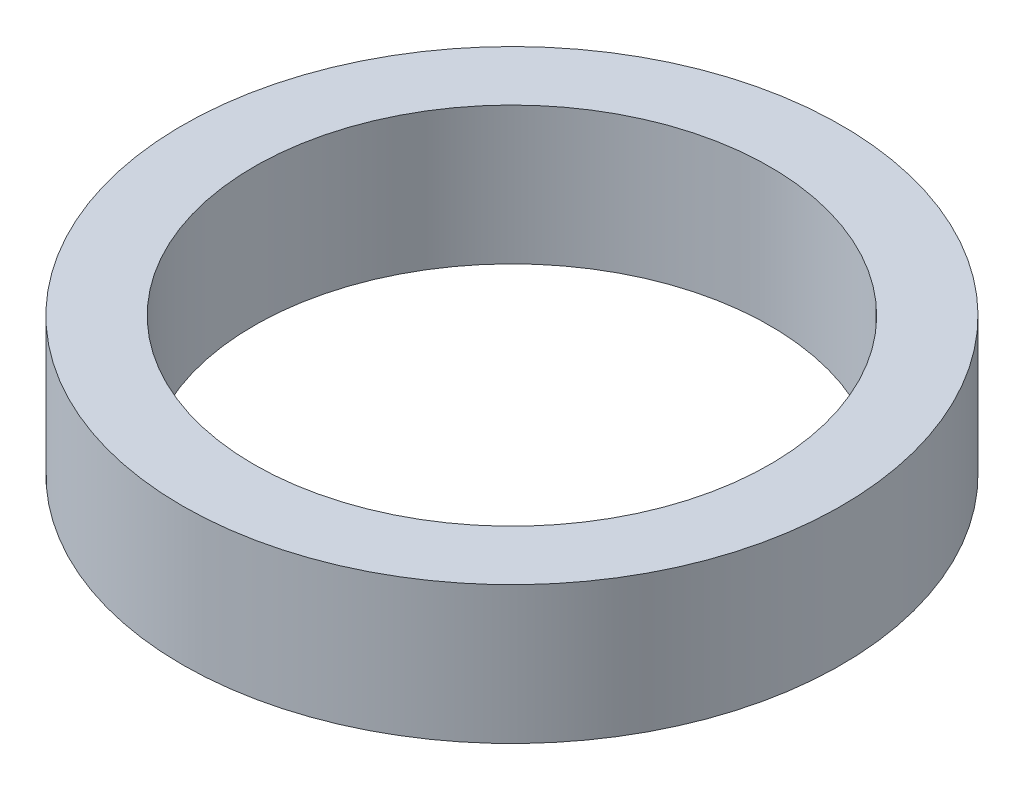
ISO-10303-21;
HEADER;
FILE_DESCRIPTION(('STEP AP214'),'2;1');
FILE_NAME('part.step','',(''),(''),'','','');
FILE_SCHEMA(('AUTOMOTIVE_DESIGN { 1 0 10303 214 1 1 1 1 }'));
ENDSEC;
DATA;
#1=APPLICATION_CONTEXT('core data for automotive mechanical design processes');
#2=APPLICATION_PROTOCOL_DEFINITION('international standard','automotive_design',2000,#1);
#3=PRODUCT_CONTEXT('',#1,'mechanical');
#4=PRODUCT('Part','Part','',(#3));
#5=PRODUCT_RELATED_PRODUCT_CATEGORY('part','',(#4));
#6=PRODUCT_DEFINITION_FORMATION('','',#4);
#7=PRODUCT_DEFINITION_CONTEXT('part definition',#1,'design');
#8=PRODUCT_DEFINITION('design','',#6,#7);
#9=PRODUCT_DEFINITION_SHAPE('','',#8);
#10=(LENGTH_UNIT() NAMED_UNIT(*) SI_UNIT(.MILLI.,.METRE.));
#11=(NAMED_UNIT(*) PLANE_ANGLE_UNIT() SI_UNIT($,.RADIAN.));
#12=(NAMED_UNIT(*) SI_UNIT($,.STERADIAN.) SOLID_ANGLE_UNIT());
#13=UNCERTAINTY_MEASURE_WITH_UNIT(LENGTH_MEASURE(1.E-05),#10,'distance_accuracy_value','');
#14=(GEOMETRIC_REPRESENTATION_CONTEXT(3) GLOBAL_UNCERTAINTY_ASSIGNED_CONTEXT((#13)) GLOBAL_UNIT_ASSIGNED_CONTEXT((#10,
#11,#12)) REPRESENTATION_CONTEXT('',''));
#15=CARTESIAN_POINT('',(0.,0.,0.));
#16=DIRECTION('',(0.,0.,1.));
#17=DIRECTION('',(1.,0.,0.));
#18=AXIS2_PLACEMENT_3D('',#15,#16,#17);
#19=CARTESIAN_POINT('',(0.,24.,0.));
#20=DIRECTION('',(0.,-1.,0.));
#21=DIRECTION('',(0.,0.,-1.));
#22=AXIS2_PLACEMENT_3D('',#19,#20,#21);
#23=CYLINDRICAL_SURFACE('',#22,57.5);
#24=CARTESIAN_POINT('',(0.,24.,0.));
#25=DIRECTION('',(0.,1.,0.));
#26=DIRECTION('',(0.,0.,1.));
#27=AXIS2_PLACEMENT_3D('',#24,#25,#26);
#28=CIRCLE('',#27,57.5);
#29=CARTESIAN_POINT('',(0.,24.,57.5));
#30=VERTEX_POINT('',#29);
#31=EDGE_CURVE('E10',#30,#30,#28,.T.);
#32=ORIENTED_EDGE('',*,*,#31,.F.);
#33=EDGE_LOOP('',(#32));
#34=FACE_BOUND('',#33,.T.);
#35=CARTESIAN_POINT('',(0.,0.,0.));
#36=DIRECTION('',(0.,1.,0.));
#37=DIRECTION('',(0.,0.,1.));
#38=AXIS2_PLACEMENT_3D('',#35,#36,#37);
#39=CIRCLE('',#38,57.5);
#40=CARTESIAN_POINT('',(0.,0.,57.5));
#41=VERTEX_POINT('',#40);
#42=EDGE_CURVE('E37',#41,#41,#39,.T.);
#43=ORIENTED_EDGE('',*,*,#42,.T.);
#44=EDGE_LOOP('',(#43));
#45=FACE_BOUND('',#44,.T.);
#46=ADVANCED_FACE('F40',(#34,#45),#23,.T.);
#47=CARTESIAN_POINT('',(0.,24.,0.));
#48=DIRECTION('',(0.,1.,0.));
#49=DIRECTION('',(0.,0.,1.));
#50=AXIS2_PLACEMENT_3D('',#47,#48,#49);
#51=PLANE('',#50);
#52=CARTESIAN_POINT('',(0.,24.,0.));
#53=DIRECTION('',(0.,1.,0.));
#54=DIRECTION('',(0.,0.,1.));
#55=AXIS2_PLACEMENT_3D('',#52,#53,#54);
#56=CIRCLE('',#55,45.);
#57=CARTESIAN_POINT('',(0.,24.,45.));
#58=VERTEX_POINT('',#57);
#59=EDGE_CURVE('E50',#58,#58,#56,.T.);
#60=ORIENTED_EDGE('',*,*,#59,.F.);
#61=EDGE_LOOP('',(#60));
#62=FACE_BOUND('',#61,.T.);
#63=ORIENTED_EDGE('',*,*,#31,.T.);
#64=EDGE_LOOP('',(#63));
#65=FACE_BOUND('',#64,.T.);
#66=ADVANCED_FACE('F59',(#62,#65),#51,.T.);
#67=CARTESIAN_POINT('',(0.,0.,0.));
#68=DIRECTION('',(0.,1.,0.));
#69=DIRECTION('',(0.,0.,1.));
#70=AXIS2_PLACEMENT_3D('',#67,#68,#69);
#71=PLANE('',#70);
#72=CARTESIAN_POINT('',(0.,0.,0.));
#73=DIRECTION('',(0.,1.,0.));
#74=DIRECTION('',(0.,0.,1.));
#75=AXIS2_PLACEMENT_3D('',#72,#73,#74);
#76=CIRCLE('',#75,45.);
#77=CARTESIAN_POINT('',(0.,0.,45.));
#78=VERTEX_POINT('',#77);
#79=EDGE_CURVE('E47',#78,#78,#76,.T.);
#80=ORIENTED_EDGE('',*,*,#79,.T.);
#81=EDGE_LOOP('',(#80));
#82=FACE_BOUND('',#81,.T.);
#83=ORIENTED_EDGE('',*,*,#42,.F.);
#84=EDGE_LOOP('',(#83));
#85=FACE_BOUND('',#84,.T.);
#86=ADVANCED_FACE('F58',(#82,#85),#71,.F.);
#87=CARTESIAN_POINT('',(0.,24.,0.));
#88=DIRECTION('',(0.,-1.,0.));
#89=DIRECTION('',(0.,0.,-1.));
#90=AXIS2_PLACEMENT_3D('',#87,#88,#89);
#91=CYLINDRICAL_SURFACE('',#90,45.);
#92=ORIENTED_EDGE('',*,*,#59,.T.);
#93=EDGE_LOOP('',(#92));
#94=FACE_BOUND('',#93,.T.);
#95=ORIENTED_EDGE('',*,*,#79,.F.);
#96=EDGE_LOOP('',(#95));
#97=FACE_BOUND('',#96,.T.);
#98=ADVANCED_FACE('F54',(#94,#97),#91,.F.);
#99=CLOSED_SHELL('',(#46,#66,#86,#98));
#100=MANIFOLD_SOLID_BREP('B2',#99);
#101=ADVANCED_BREP_SHAPE_REPRESENTATION('',(#18,#100),#14);
#102=SHAPE_DEFINITION_REPRESENTATION(#9,#101);
ENDSEC;
END-ISO-10303-21;
